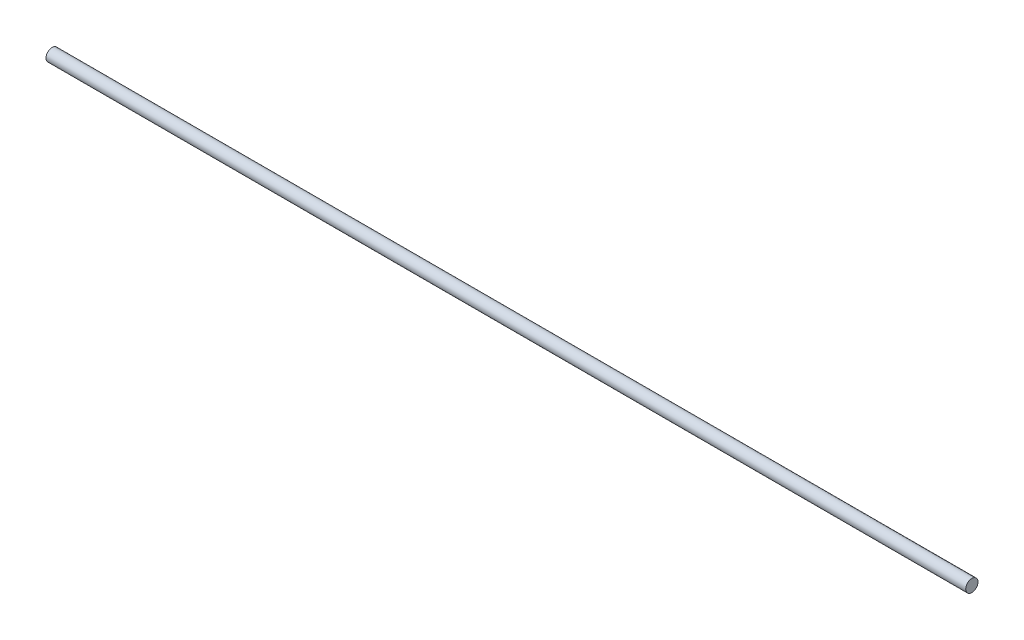
ISO-10303-21;
HEADER;
FILE_DESCRIPTION(('STEP AP214'),'2;1');
FILE_NAME('part.step','',(''),(''),'','','');
FILE_SCHEMA(('AUTOMOTIVE_DESIGN { 1 0 10303 214 1 1 1 1 }'));
ENDSEC;
DATA;
#1=APPLICATION_CONTEXT('core data for automotive mechanical design processes');
#2=APPLICATION_PROTOCOL_DEFINITION('international standard','automotive_design',2000,#1);
#3=PRODUCT_CONTEXT('',#1,'mechanical');
#4=PRODUCT('Part','Part','',(#3));
#5=PRODUCT_RELATED_PRODUCT_CATEGORY('part','',(#4));
#6=PRODUCT_DEFINITION_FORMATION('','',#4);
#7=PRODUCT_DEFINITION_CONTEXT('part definition',#1,'design');
#8=PRODUCT_DEFINITION('design','',#6,#7);
#9=PRODUCT_DEFINITION_SHAPE('','',#8);
#10=(LENGTH_UNIT() NAMED_UNIT(*) SI_UNIT(.MILLI.,.METRE.));
#11=(NAMED_UNIT(*) PLANE_ANGLE_UNIT() SI_UNIT($,.RADIAN.));
#12=(NAMED_UNIT(*) SI_UNIT($,.STERADIAN.) SOLID_ANGLE_UNIT());
#13=UNCERTAINTY_MEASURE_WITH_UNIT(LENGTH_MEASURE(1.E-05),#10,'distance_accuracy_value','');
#14=(GEOMETRIC_REPRESENTATION_CONTEXT(3) GLOBAL_UNCERTAINTY_ASSIGNED_CONTEXT((#13)) GLOBAL_UNIT_ASSIGNED_CONTEXT((#10,
#11,#12)) REPRESENTATION_CONTEXT('',''));
#15=CARTESIAN_POINT('',(0.,0.,0.));
#16=DIRECTION('',(0.,0.,1.));
#17=DIRECTION('',(1.,0.,0.));
#18=AXIS2_PLACEMENT_3D('',#15,#16,#17);
#19=CARTESIAN_POINT('',(-300.,0.,0.));
#20=DIRECTION('',(1.,0.,0.));
#21=DIRECTION('',(0.,0.,-1.));
#22=AXIS2_PLACEMENT_3D('',#19,#20,#21);
#23=CYLINDRICAL_SURFACE('',#22,4.);
#24=CARTESIAN_POINT('',(-300.,0.,0.));
#25=DIRECTION('',(1.,0.,0.));
#26=DIRECTION('',(0.,0.,-1.));
#27=AXIS2_PLACEMENT_3D('',#24,#25,#26);
#28=CIRCLE('',#27,4.);
#29=CARTESIAN_POINT('',(-300.,0.,-4.));
#30=VERTEX_POINT('',#29);
#31=EDGE_CURVE('E10',#30,#30,#28,.T.);
#32=ORIENTED_EDGE('',*,*,#31,.T.);
#33=EDGE_LOOP('',(#32));
#34=FACE_BOUND('',#33,.T.);
#35=CARTESIAN_POINT('',(300.,0.,0.));
#36=DIRECTION('',(1.,0.,0.));
#37=DIRECTION('',(0.,0.,-1.));
#38=AXIS2_PLACEMENT_3D('',#35,#36,#37);
#39=CIRCLE('',#38,4.);
#40=CARTESIAN_POINT('',(300.,0.,-4.));
#41=VERTEX_POINT('',#40);
#42=EDGE_CURVE('E36',#41,#41,#39,.T.);
#43=ORIENTED_EDGE('',*,*,#42,.F.);
#44=EDGE_LOOP('',(#43));
#45=FACE_BOUND('',#44,.T.);
#46=ADVANCED_FACE('F30',(#34,#45),#23,.T.);
#47=CARTESIAN_POINT('',(-300.,0.,0.));
#48=DIRECTION('',(1.,0.,0.));
#49=DIRECTION('',(0.,0.,-1.));
#50=AXIS2_PLACEMENT_3D('',#47,#48,#49);
#51=PLANE('',#50);
#52=ORIENTED_EDGE('',*,*,#31,.F.);
#53=EDGE_LOOP('',(#52));
#54=FACE_BOUND('',#53,.T.);
#55=ADVANCED_FACE('F45',(#54),#51,.F.);
#56=CARTESIAN_POINT('',(300.,0.,0.));
#57=DIRECTION('',(1.,0.,0.));
#58=DIRECTION('',(0.,0.,-1.));
#59=AXIS2_PLACEMENT_3D('',#56,#57,#58);
#60=PLANE('',#59);
#61=ORIENTED_EDGE('',*,*,#42,.T.);
#62=EDGE_LOOP('',(#61));
#63=FACE_BOUND('',#62,.T.);
#64=ADVANCED_FACE('F42',(#63),#60,.T.);
#65=CLOSED_SHELL('',(#46,#55,#64));
#66=MANIFOLD_SOLID_BREP('B2',#65);
#67=ADVANCED_BREP_SHAPE_REPRESENTATION('',(#18,#66),#14);
#68=SHAPE_DEFINITION_REPRESENTATION(#9,#67);
ENDSEC;
END-ISO-10303-21;
